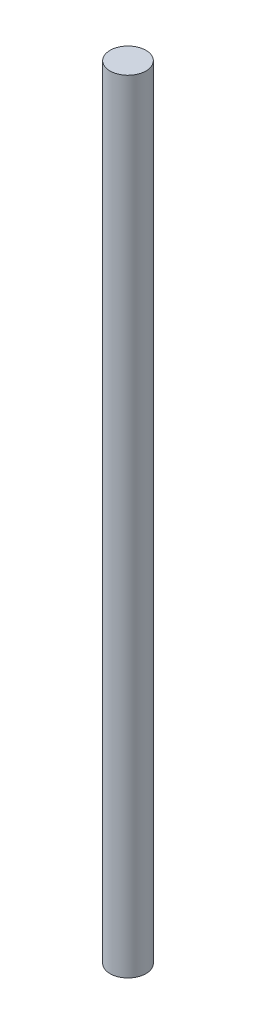
ISO-10303-21;
HEADER;
FILE_DESCRIPTION(('STEP AP214'),'2;1');
FILE_NAME('part.step','',(''),(''),'','','');
FILE_SCHEMA(('AUTOMOTIVE_DESIGN { 1 0 10303 214 1 1 1 1 }'));
ENDSEC;
DATA;
#1=APPLICATION_CONTEXT('core data for automotive mechanical design processes');
#2=APPLICATION_PROTOCOL_DEFINITION('international standard','automotive_design',2000,#1);
#3=PRODUCT_CONTEXT('',#1,'mechanical');
#4=PRODUCT('Part','Part','',(#3));
#5=PRODUCT_RELATED_PRODUCT_CATEGORY('part','',(#4));
#6=PRODUCT_DEFINITION_FORMATION('','',#4);
#7=PRODUCT_DEFINITION_CONTEXT('part definition',#1,'design');
#8=PRODUCT_DEFINITION('design','',#6,#7);
#9=PRODUCT_DEFINITION_SHAPE('','',#8);
#10=(LENGTH_UNIT() NAMED_UNIT(*) SI_UNIT(.MILLI.,.METRE.));
#11=(NAMED_UNIT(*) PLANE_ANGLE_UNIT() SI_UNIT($,.RADIAN.));
#12=(NAMED_UNIT(*) SI_UNIT($,.STERADIAN.) SOLID_ANGLE_UNIT());
#13=UNCERTAINTY_MEASURE_WITH_UNIT(LENGTH_MEASURE(1.E-05),#10,'distance_accuracy_value','');
#14=(GEOMETRIC_REPRESENTATION_CONTEXT(3) GLOBAL_UNCERTAINTY_ASSIGNED_CONTEXT((#13)) GLOBAL_UNIT_ASSIGNED_CONTEXT((#10,
#11,#12)) REPRESENTATION_CONTEXT('',''));
#15=CARTESIAN_POINT('',(0.,0.,0.));
#16=DIRECTION('',(0.,0.,1.));
#17=DIRECTION('',(1.,0.,0.));
#18=AXIS2_PLACEMENT_3D('',#15,#16,#17);
#19=CARTESIAN_POINT('',(1.11022302462516E-13,109.,0.));
#20=DIRECTION('',(0.,-0.999999999999998,0.));
#21=DIRECTION('',(0.,0.,-1.));
#22=AXIS2_PLACEMENT_3D('',#19,#20,#21);
#23=CYLINDRICAL_SURFACE('',#22,2.5);
#24=CARTESIAN_POINT('',(1.11022302462516E-13,109.,0.));
#25=DIRECTION('',(0.,0.999999999999998,0.));
#26=DIRECTION('',(0.,0.,1.));
#27=AXIS2_PLACEMENT_3D('',#24,#25,#26);
#28=CIRCLE('',#27,2.5);
#29=CARTESIAN_POINT('',(1.10883524584438E-13,109.,2.49999999999995));
#30=VERTEX_POINT('',#29);
#31=EDGE_CURVE('E10',#30,#30,#28,.T.);
#32=ORIENTED_EDGE('',*,*,#31,.F.);
#33=EDGE_LOOP('',(#32));
#34=FACE_BOUND('',#33,.T.);
#35=CARTESIAN_POINT('',(0.,0.,0.));
#36=DIRECTION('',(0.,0.999999999999998,0.));
#37=DIRECTION('',(0.,0.,1.));
#38=AXIS2_PLACEMENT_3D('',#35,#36,#37);
#39=CIRCLE('',#38,2.5);
#40=CARTESIAN_POINT('',(0.,0.,2.5));
#41=VERTEX_POINT('',#40);
#42=EDGE_CURVE('E37',#41,#41,#39,.T.);
#43=ORIENTED_EDGE('',*,*,#42,.T.);
#44=EDGE_LOOP('',(#43));
#45=FACE_BOUND('',#44,.T.);
#46=ADVANCED_FACE('F34',(#34,#45),#23,.T.);
#47=CARTESIAN_POINT('',(1.11022302462516E-13,109.,0.));
#48=DIRECTION('',(0.,0.999999999999998,0.));
#49=DIRECTION('',(0.,0.,1.));
#50=AXIS2_PLACEMENT_3D('',#47,#48,#49);
#51=PLANE('',#50);
#52=ORIENTED_EDGE('',*,*,#31,.T.);
#53=EDGE_LOOP('',(#52));
#54=FACE_BOUND('',#53,.T.);
#55=ADVANCED_FACE('F53',(#54),#51,.T.);
#56=CARTESIAN_POINT('',(0.,0.,0.));
#57=DIRECTION('',(0.,0.999999999999998,0.));
#58=DIRECTION('',(0.,0.,1.));
#59=AXIS2_PLACEMENT_3D('',#56,#57,#58);
#60=PLANE('',#59);
#61=ORIENTED_EDGE('',*,*,#42,.F.);
#62=EDGE_LOOP('',(#61));
#63=FACE_BOUND('',#62,.T.);
#64=ADVANCED_FACE('F51',(#63),#60,.F.);
#65=CLOSED_SHELL('',(#46,#55,#64));
#66=MANIFOLD_SOLID_BREP('B2',#65);
#67=ADVANCED_BREP_SHAPE_REPRESENTATION('',(#18,#66),#14);
#68=SHAPE_DEFINITION_REPRESENTATION(#9,#67);
ENDSEC;
END-ISO-10303-21;
